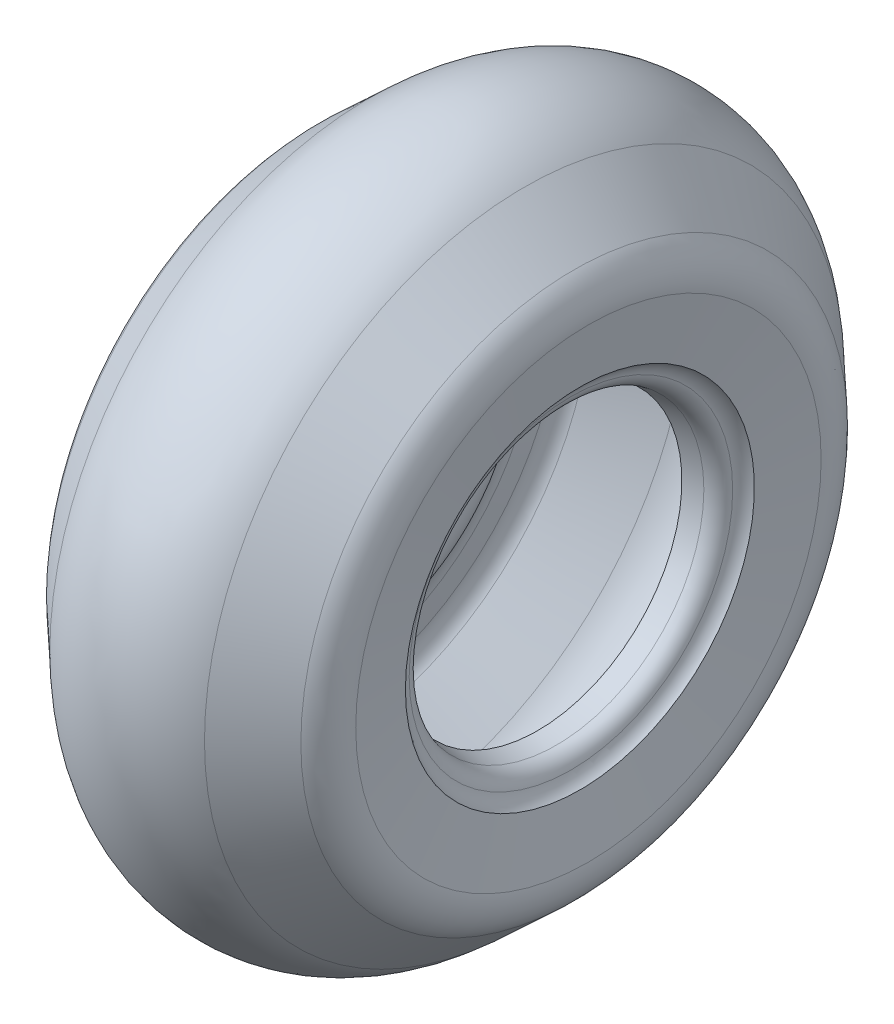
ISO-10303-21;
HEADER;
FILE_DESCRIPTION(('STEP AP214'),'2;1');
FILE_NAME('part.step','',(''),(''),'','','');
FILE_SCHEMA(('AUTOMOTIVE_DESIGN { 1 0 10303 214 1 1 1 1 }'));
ENDSEC;
DATA;
#1=APPLICATION_CONTEXT('core data for automotive mechanical design processes');
#2=APPLICATION_PROTOCOL_DEFINITION('international standard','automotive_design',2000,#1);
#3=PRODUCT_CONTEXT('',#1,'mechanical');
#4=PRODUCT('Part','Part','',(#3));
#5=PRODUCT_RELATED_PRODUCT_CATEGORY('part','',(#4));
#6=PRODUCT_DEFINITION_FORMATION('','',#4);
#7=PRODUCT_DEFINITION_CONTEXT('part definition',#1,'design');
#8=PRODUCT_DEFINITION('design','',#6,#7);
#9=PRODUCT_DEFINITION_SHAPE('','',#8);
#10=(LENGTH_UNIT() NAMED_UNIT(*) SI_UNIT(.MILLI.,.METRE.));
#11=(NAMED_UNIT(*) PLANE_ANGLE_UNIT() SI_UNIT($,.RADIAN.));
#12=(NAMED_UNIT(*) SI_UNIT($,.STERADIAN.) SOLID_ANGLE_UNIT());
#13=UNCERTAINTY_MEASURE_WITH_UNIT(LENGTH_MEASURE(1.E-05),#10,'distance_accuracy_value','');
#14=(GEOMETRIC_REPRESENTATION_CONTEXT(3) GLOBAL_UNCERTAINTY_ASSIGNED_CONTEXT((#13)) GLOBAL_UNIT_ASSIGNED_CONTEXT((#10,
#11,#12)) REPRESENTATION_CONTEXT('',''));
#15=CARTESIAN_POINT('',(0.,0.,0.));
#16=DIRECTION('',(0.,0.,1.));
#17=DIRECTION('',(1.,0.,0.));
#18=AXIS2_PLACEMENT_3D('',#15,#16,#17);
#19=CARTESIAN_POINT('',(0.,0.,0.));
#20=DIRECTION('',(-1.,0.,0.));
#21=DIRECTION('',(0.,0.,1.));
#22=AXIS2_PLACEMENT_3D('',#19,#20,#21);
#23=TOROIDAL_SURFACE('',#22,197.225,94.3690016030858);
#24=CARTESIAN_POINT('',(64.3595043340397,0.,0.));
#25=DIRECTION('',(-1.,0.,0.));
#26=DIRECTION('',(0.,0.,1.));
#27=AXIS2_PLACEMENT_3D('',#24,#25,#26);
#28=CIRCLE('',#27,266.242118640522);
#29=CARTESIAN_POINT('',(64.3595043340397,0.,266.242118640522));
#30=VERTEX_POINT('',#29);
#31=EDGE_CURVE('E10',#30,#30,#28,.T.);
#32=ORIENTED_EDGE('',*,*,#31,.T.);
#33=EDGE_LOOP('',(#32));
#34=FACE_BOUND('',#33,.T.);
#35=CARTESIAN_POINT('',(-64.3595043340397,0.,0.));
#36=DIRECTION('',(-1.,0.,0.));
#37=DIRECTION('',(0.,0.,1.));
#38=AXIS2_PLACEMENT_3D('',#35,#36,#37);
#39=CIRCLE('',#38,266.242118640522);
#40=CARTESIAN_POINT('',(-64.3595043340397,0.,266.242118640522));
#41=VERTEX_POINT('',#40);
#42=EDGE_CURVE('E140',#41,#41,#39,.T.);
#43=ORIENTED_EDGE('',*,*,#42,.F.);
#44=EDGE_LOOP('',(#43));
#45=FACE_BOUND('',#44,.T.);
#46=ADVANCED_FACE('F39',(#34,#45),#23,.T.);
#47=CARTESIAN_POINT('',(64.3595043340397,0.,0.));
#48=DIRECTION('',(-1.,0.,0.));
#49=DIRECTION('',(0.,0.,1.));
#50=AXIS2_PLACEMENT_3D('',#47,#48,#49);
#51=CONICAL_SURFACE('',#50,266.242118640522,0.750491578357559);
#52=CARTESIAN_POINT('',(105.87360829989,0.,0.));
#53=DIRECTION('',(-1.,0.,0.));
#54=DIRECTION('',(0.,0.,1.));
#55=AXIS2_PLACEMENT_3D('',#52,#53,#54);
#56=CIRCLE('',#55,227.52959040488);
#57=CARTESIAN_POINT('',(105.87360829989,0.,227.52959040488));
#58=VERTEX_POINT('',#57);
#59=EDGE_CURVE('E46',#58,#58,#56,.T.);
#60=ORIENTED_EDGE('',*,*,#59,.T.);
#61=EDGE_LOOP('',(#60));
#62=FACE_BOUND('',#61,.T.);
#63=ORIENTED_EDGE('',*,*,#31,.F.);
#64=EDGE_LOOP('',(#63));
#65=FACE_BOUND('',#64,.T.);
#66=ADVANCED_FACE('F150',(#62,#65),#51,.T.);
#67=CARTESIAN_POINT('',(79.5569965809781,0.,0.));
#68=DIRECTION('',(-1.,0.,0.));
#69=DIRECTION('',(0.,0.,1.));
#70=AXIS2_PLACEMENT_3D('',#67,#68,#69);
#71=TOROIDAL_SURFACE('',#70,199.30847944365,38.5875);
#72=CARTESIAN_POINT('',(117.73475,0.,0.));
#73=DIRECTION('',(-1.,0.,0.));
#74=DIRECTION('',(0.,0.,1.));
#75=AXIS2_PLACEMENT_3D('',#72,#73,#74);
#76=CIRCLE('',#75,193.700066109528);
#77=CARTESIAN_POINT('',(117.73475,0.,193.700066109528));
#78=VERTEX_POINT('',#77);
#79=EDGE_CURVE('E52',#78,#78,#76,.T.);
#80=ORIENTED_EDGE('',*,*,#79,.T.);
#81=EDGE_LOOP('',(#80));
#82=FACE_BOUND('',#81,.T.);
#83=ORIENTED_EDGE('',*,*,#59,.F.);
#84=EDGE_LOOP('',(#83));
#85=FACE_BOUND('',#84,.T.);
#86=ADVANCED_FACE('F154',(#82,#85),#71,.T.);
#87=CARTESIAN_POINT('',(117.73475,0.,0.));
#88=DIRECTION('',(1.,0.,0.));
#89=DIRECTION('',(0.,0.,-1.));
#90=AXIS2_PLACEMENT_3D('',#87,#88,#89);
#91=CONICAL_SURFACE('',#90,193.700066109528,1.42493693532447);
#92=CARTESIAN_POINT('',(110.6175,0.,0.));
#93=DIRECTION('',(-1.,0.,0.));
#94=DIRECTION('',(0.,0.,1.));
#95=AXIS2_PLACEMENT_3D('',#92,#93,#94);
#96=CIRCLE('',#95,145.251316109528);
#97=CARTESIAN_POINT('',(110.6175,0.,145.251316109528));
#98=VERTEX_POINT('',#97);
#99=EDGE_CURVE('E58',#98,#98,#96,.T.);
#100=ORIENTED_EDGE('',*,*,#99,.T.);
#101=EDGE_LOOP('',(#100));
#102=FACE_BOUND('',#101,.T.);
#103=ORIENTED_EDGE('',*,*,#79,.F.);
#104=EDGE_LOOP('',(#103));
#105=FACE_BOUND('',#104,.T.);
#106=ADVANCED_FACE('F158',(#102,#105),#91,.F.);
#107=CARTESIAN_POINT('',(119.869637613001,0.,0.));
#108=DIRECTION('',(-1.,0.,0.));
#109=DIRECTION('',(0.,0.,1.));
#110=AXIS2_PLACEMENT_3D('',#107,#108,#109);
#111=TOROIDAL_SURFACE('',#110,130.811078937304,17.15);
#112=CARTESIAN_POINT('',(103.154901682086,0.,0.));
#113=DIRECTION('',(-1.,0.,0.));
#114=DIRECTION('',(0.,0.,1.));
#115=AXIS2_PLACEMENT_3D('',#112,#113,#114);
#116=CIRCLE('',#115,134.650363084092);
#117=CARTESIAN_POINT('',(103.154901682086,0.,134.650363084092));
#118=VERTEX_POINT('',#117);
#119=EDGE_CURVE('E64',#118,#118,#116,.T.);
#120=ORIENTED_EDGE('',*,*,#119,.T.);
#121=EDGE_LOOP('',(#120));
#122=FACE_BOUND('',#121,.T.);
#123=ORIENTED_EDGE('',*,*,#99,.F.);
#124=EDGE_LOOP('',(#123));
#125=FACE_BOUND('',#124,.T.);
#126=ADVANCED_FACE('F165',(#122,#125),#111,.F.);
#127=CARTESIAN_POINT('',(88.1116393442622,0.,0.));
#128=DIRECTION('',(-1.,0.,0.));
#129=DIRECTION('',(0.,0.,1.));
#130=AXIS2_PLACEMENT_3D('',#127,#128,#129);
#131=TOROIDAL_SURFACE('',#130,138.105718816201,15.435);
#132=CARTESIAN_POINT('',(90.895,0.,0.));
#133=DIRECTION('',(-1.,0.,0.));
#134=DIRECTION('',(0.,0.,1.));
#135=AXIS2_PLACEMENT_3D('',#132,#133,#134);
#136=CIRCLE('',#135,122.923751603086);
#137=CARTESIAN_POINT('',(90.895,0.,122.923751603086));
#138=VERTEX_POINT('',#137);
#139=EDGE_CURVE('E68',#138,#138,#136,.T.);
#140=ORIENTED_EDGE('',*,*,#139,.T.);
#141=EDGE_LOOP('',(#140));
#142=FACE_BOUND('',#141,.T.);
#143=ORIENTED_EDGE('',*,*,#119,.F.);
#144=EDGE_LOOP('',(#143));
#145=FACE_BOUND('',#144,.T.);
#146=ADVANCED_FACE('F169',(#142,#145),#131,.T.);
#147=CARTESIAN_POINT('',(90.895,0.,0.));
#148=DIRECTION('',(1.,0.,0.));
#149=DIRECTION('',(0.,0.,-1.));
#150=AXIS2_PLACEMENT_3D('',#147,#148,#149);
#151=CONICAL_SURFACE('',#150,122.923751603086,0.181319774401494);
#152=CARTESIAN_POINT('',(75.46,0.,0.));
#153=DIRECTION('',(-1.,0.,0.));
#154=DIRECTION('',(0.,0.,1.));
#155=AXIS2_PLACEMENT_3D('',#152,#153,#154);
#156=CIRCLE('',#155,120.094001603086);
#157=CARTESIAN_POINT('',(75.46,0.,120.094001603086));
#158=VERTEX_POINT('',#157);
#159=EDGE_CURVE('E72',#158,#158,#156,.T.);
#160=ORIENTED_EDGE('',*,*,#159,.T.);
#161=EDGE_LOOP('',(#160));
#162=FACE_BOUND('',#161,.T.);
#163=ORIENTED_EDGE('',*,*,#139,.F.);
#164=EDGE_LOOP('',(#163));
#165=FACE_BOUND('',#164,.T.);
#166=ADVANCED_FACE('F173',(#162,#165),#151,.F.);
#167=CARTESIAN_POINT('',(123.352659152275,0.,0.));
#168=DIRECTION('',(-1.,0.,0.));
#169=DIRECTION('',(0.,0.,1.));
#170=AXIS2_PLACEMENT_3D('',#167,#168,#169);
#171=TOROIDAL_SURFACE('',#170,116.599205568409,48.02);
#172=CARTESIAN_POINT('',(87.8423,0.,0.));
#173=DIRECTION('',(-1.,0.,0.));
#174=DIRECTION('',(0.,0.,1.));
#175=AXIS2_PLACEMENT_3D('',#172,#173,#174);
#176=CIRCLE('',#175,148.924656731176);
#177=CARTESIAN_POINT('',(87.8423,0.,148.924656731176));
#178=VERTEX_POINT('',#177);
#179=EDGE_CURVE('E76',#178,#178,#176,.T.);
#180=ORIENTED_EDGE('',*,*,#179,.T.);
#181=EDGE_LOOP('',(#180));
#182=FACE_BOUND('',#181,.T.);
#183=ORIENTED_EDGE('',*,*,#159,.F.);
#184=EDGE_LOOP('',(#183));
#185=FACE_BOUND('',#184,.T.);
#186=ADVANCED_FACE('F177',(#182,#185),#171,.T.);
#187=CARTESIAN_POINT('',(43.4543510596561,0.,0.));
#188=DIRECTION('',(-1.,0.,0.));
#189=DIRECTION('',(0.,0.,1.));
#190=AXIS2_PLACEMENT_3D('',#187,#188,#189);
#191=TOROIDAL_SURFACE('',#190,189.331470684634,60.025);
#192=CARTESIAN_POINT('',(102.521721627711,0.,0.));
#193=DIRECTION('',(-1.,0.,0.));
#194=DIRECTION('',(0.,0.,1.));
#195=AXIS2_PLACEMENT_3D('',#192,#193,#194);
#196=CIRCLE('',#195,178.652221685942);
#197=CARTESIAN_POINT('',(102.521721627711,0.,178.652221685942));
#198=VERTEX_POINT('',#197);
#199=EDGE_CURVE('E80',#198,#198,#196,.T.);
#200=ORIENTED_EDGE('',*,*,#199,.T.);
#201=EDGE_LOOP('',(#200));
#202=FACE_BOUND('',#201,.T.);
#203=ORIENTED_EDGE('',*,*,#179,.F.);
#204=EDGE_LOOP('',(#203));
#205=FACE_BOUND('',#204,.T.);
#206=ADVANCED_FACE('F181',(#202,#205),#191,.F.);
#207=CARTESIAN_POINT('',(102.521721627711,0.,0.));
#208=DIRECTION('',(1.,0.,0.));
#209=DIRECTION('',(0.,0.,-1.));
#210=AXIS2_PLACEMENT_3D('',#207,#208,#209);
#211=CONICAL_SURFACE('',#210,178.652221685942,1.39193076077594);
#212=CARTESIAN_POINT('',(106.630125,0.,0.));
#213=DIRECTION('',(-1.,0.,0.));
#214=DIRECTION('',(0.,0.,1.));
#215=AXIS2_PLACEMENT_3D('',#212,#213,#214);
#216=CIRCLE('',#215,201.375971685942);
#217=CARTESIAN_POINT('',(106.630125,0.,201.375971685942));
#218=VERTEX_POINT('',#217);
#219=EDGE_CURVE('E84',#218,#218,#216,.T.);
#220=ORIENTED_EDGE('',*,*,#219,.T.);
#221=EDGE_LOOP('',(#220));
#222=FACE_BOUND('',#221,.T.);
#223=ORIENTED_EDGE('',*,*,#199,.F.);
#224=EDGE_LOOP('',(#223));
#225=FACE_BOUND('',#224,.T.);
#226=ADVANCED_FACE('F185',(#222,#225),#211,.T.);
#227=CARTESIAN_POINT('',(85.1127257216372,0.,0.));
#228=DIRECTION('',(-1.,0.,0.));
#229=DIRECTION('',(0.,0.,1.));
#230=AXIS2_PLACEMENT_3D('',#227,#228,#229);
#231=TOROIDAL_SURFACE('',#230,205.266269535465,21.86625);
#232=CARTESIAN_POINT('',(100.025472362354,0.,0.));
#233=DIRECTION('',(-1.,0.,0.));
#234=DIRECTION('',(0.,0.,1.));
#235=AXIS2_PLACEMENT_3D('',#232,#233,#234);
#236=CIRCLE('',#235,221.258232413496);
#237=CARTESIAN_POINT('',(100.025472362354,0.,221.258232413496));
#238=VERTEX_POINT('',#237);
#239=EDGE_CURVE('E88',#238,#238,#236,.T.);
#240=ORIENTED_EDGE('',*,*,#239,.T.);
#241=EDGE_LOOP('',(#240));
#242=FACE_BOUND('',#241,.T.);
#243=ORIENTED_EDGE('',*,*,#219,.F.);
#244=EDGE_LOOP('',(#243));
#245=FACE_BOUND('',#244,.T.);
#246=ADVANCED_FACE('F189',(#242,#245),#231,.F.);
#247=CARTESIAN_POINT('',(100.025472362354,0.,0.));
#248=DIRECTION('',(-1.,0.,0.));
#249=DIRECTION('',(0.,0.,1.));
#250=AXIS2_PLACEMENT_3D('',#247,#248,#249);
#251=CONICAL_SURFACE('',#250,221.258232413496,0.75049157835756);
#252=CARTESIAN_POINT('',(58.5113683965037,0.,0.));
#253=DIRECTION('',(-1.,0.,0.));
#254=DIRECTION('',(0.,0.,1.));
#255=AXIS2_PLACEMENT_3D('',#252,#253,#254);
#256=CIRCLE('',#255,259.970760649138);
#257=CARTESIAN_POINT('',(58.5113683965037,0.,259.970760649138));
#258=VERTEX_POINT('',#257);
#259=EDGE_CURVE('E92',#258,#258,#256,.T.);
#260=ORIENTED_EDGE('',*,*,#259,.T.);
#261=EDGE_LOOP('',(#260));
#262=FACE_BOUND('',#261,.T.);
#263=ORIENTED_EDGE('',*,*,#239,.F.);
#264=EDGE_LOOP('',(#263));
#265=FACE_BOUND('',#264,.T.);
#266=ADVANCED_FACE('F193',(#262,#265),#251,.F.);
#267=CARTESIAN_POINT('',(0.,0.,0.));
#268=DIRECTION('',(-1.,0.,0.));
#269=DIRECTION('',(0.,0.,1.));
#270=AXIS2_PLACEMENT_3D('',#267,#268,#269);
#271=TOROIDAL_SURFACE('',#270,197.225,85.7940016030858);
#272=CARTESIAN_POINT('',(-58.5113683965038,0.,0.));
#273=DIRECTION('',(-1.,0.,0.));
#274=DIRECTION('',(0.,0.,1.));
#275=AXIS2_PLACEMENT_3D('',#272,#273,#274);
#276=CIRCLE('',#275,259.970760649138);
#277=CARTESIAN_POINT('',(-58.5113683965038,0.,259.970760649138));
#278=VERTEX_POINT('',#277);
#279=EDGE_CURVE('E96',#278,#278,#276,.T.);
#280=ORIENTED_EDGE('',*,*,#279,.T.);
#281=EDGE_LOOP('',(#280));
#282=FACE_BOUND('',#281,.T.);
#283=ORIENTED_EDGE('',*,*,#259,.F.);
#284=EDGE_LOOP('',(#283));
#285=FACE_BOUND('',#284,.T.);
#286=ADVANCED_FACE('F197',(#282,#285),#271,.F.);
#287=CARTESIAN_POINT('',(-58.5113683965038,0.,0.));
#288=DIRECTION('',(1.,0.,0.));
#289=DIRECTION('',(0.,0.,-1.));
#290=AXIS2_PLACEMENT_3D('',#287,#288,#289);
#291=CONICAL_SURFACE('',#290,259.970760649138,0.75049157835756);
#292=CARTESIAN_POINT('',(-100.025472362354,0.,0.));
#293=DIRECTION('',(-1.,0.,0.));
#294=DIRECTION('',(0.,0.,1.));
#295=AXIS2_PLACEMENT_3D('',#292,#293,#294);
#296=CIRCLE('',#295,221.258232413496);
#297=CARTESIAN_POINT('',(-100.025472362354,0.,221.258232413496));
#298=VERTEX_POINT('',#297);
#299=EDGE_CURVE('E100',#298,#298,#296,.T.);
#300=ORIENTED_EDGE('',*,*,#299,.T.);
#301=EDGE_LOOP('',(#300));
#302=FACE_BOUND('',#301,.T.);
#303=ORIENTED_EDGE('',*,*,#279,.F.);
#304=EDGE_LOOP('',(#303));
#305=FACE_BOUND('',#304,.T.);
#306=ADVANCED_FACE('F201',(#302,#305),#291,.F.);
#307=CARTESIAN_POINT('',(-85.1127257216371,0.,0.));
#308=DIRECTION('',(-1.,0.,0.));
#309=DIRECTION('',(0.,0.,1.));
#310=AXIS2_PLACEMENT_3D('',#307,#308,#309);
#311=TOROIDAL_SURFACE('',#310,205.266269535465,21.86625);
#312=CARTESIAN_POINT('',(-106.630125,0.,0.));
#313=DIRECTION('',(-1.,0.,0.));
#314=DIRECTION('',(0.,0.,1.));
#315=AXIS2_PLACEMENT_3D('',#312,#313,#314);
#316=CIRCLE('',#315,201.375971685942);
#317=CARTESIAN_POINT('',(-106.630125,0.,201.375971685942));
#318=VERTEX_POINT('',#317);
#319=EDGE_CURVE('E104',#318,#318,#316,.T.);
#320=ORIENTED_EDGE('',*,*,#319,.T.);
#321=EDGE_LOOP('',(#320));
#322=FACE_BOUND('',#321,.T.);
#323=ORIENTED_EDGE('',*,*,#299,.F.);
#324=EDGE_LOOP('',(#323));
#325=FACE_BOUND('',#324,.T.);
#326=ADVANCED_FACE('F205',(#322,#325),#311,.F.);
#327=CARTESIAN_POINT('',(-106.630125,0.,0.));
#328=DIRECTION('',(-1.,0.,0.));
#329=DIRECTION('',(0.,0.,1.));
#330=AXIS2_PLACEMENT_3D('',#327,#328,#329);
#331=CONICAL_SURFACE('',#330,201.375971685942,1.39193076077594);
#332=CARTESIAN_POINT('',(-102.521721627711,0.,0.));
#333=DIRECTION('',(-1.,0.,0.));
#334=DIRECTION('',(0.,0.,1.));
#335=AXIS2_PLACEMENT_3D('',#332,#333,#334);
#336=CIRCLE('',#335,178.652221685942);
#337=CARTESIAN_POINT('',(-102.521721627711,0.,178.652221685942));
#338=VERTEX_POINT('',#337);
#339=EDGE_CURVE('E108',#338,#338,#336,.T.);
#340=ORIENTED_EDGE('',*,*,#339,.T.);
#341=EDGE_LOOP('',(#340));
#342=FACE_BOUND('',#341,.T.);
#343=ORIENTED_EDGE('',*,*,#319,.F.);
#344=EDGE_LOOP('',(#343));
#345=FACE_BOUND('',#344,.T.);
#346=ADVANCED_FACE('F209',(#342,#345),#331,.T.);
#347=CARTESIAN_POINT('',(-43.4543510596561,0.,0.));
#348=DIRECTION('',(-1.,0.,0.));
#349=DIRECTION('',(0.,0.,1.));
#350=AXIS2_PLACEMENT_3D('',#347,#348,#349);
#351=TOROIDAL_SURFACE('',#350,189.331470684634,60.025);
#352=CARTESIAN_POINT('',(-87.8423,0.,0.));
#353=DIRECTION('',(-1.,0.,0.));
#354=DIRECTION('',(0.,0.,1.));
#355=AXIS2_PLACEMENT_3D('',#352,#353,#354);
#356=CIRCLE('',#355,148.924656731176);
#357=CARTESIAN_POINT('',(-87.8423,0.,148.924656731176));
#358=VERTEX_POINT('',#357);
#359=EDGE_CURVE('E112',#358,#358,#356,.T.);
#360=ORIENTED_EDGE('',*,*,#359,.T.);
#361=EDGE_LOOP('',(#360));
#362=FACE_BOUND('',#361,.T.);
#363=ORIENTED_EDGE('',*,*,#339,.F.);
#364=EDGE_LOOP('',(#363));
#365=FACE_BOUND('',#364,.T.);
#366=ADVANCED_FACE('F213',(#362,#365),#351,.F.);
#367=CARTESIAN_POINT('',(-123.352659152275,0.,0.));
#368=DIRECTION('',(-1.,0.,0.));
#369=DIRECTION('',(0.,0.,1.));
#370=AXIS2_PLACEMENT_3D('',#367,#368,#369);
#371=TOROIDAL_SURFACE('',#370,116.599205568409,48.02);
#372=CARTESIAN_POINT('',(-75.46,0.,0.));
#373=DIRECTION('',(-1.,0.,0.));
#374=DIRECTION('',(0.,0.,1.));
#375=AXIS2_PLACEMENT_3D('',#372,#373,#374);
#376=CIRCLE('',#375,120.094001603086);
#377=CARTESIAN_POINT('',(-75.46,0.,120.094001603086));
#378=VERTEX_POINT('',#377);
#379=EDGE_CURVE('E116',#378,#378,#376,.T.);
#380=ORIENTED_EDGE('',*,*,#379,.T.);
#381=EDGE_LOOP('',(#380));
#382=FACE_BOUND('',#381,.T.);
#383=ORIENTED_EDGE('',*,*,#359,.F.);
#384=EDGE_LOOP('',(#383));
#385=FACE_BOUND('',#384,.T.);
#386=ADVANCED_FACE('F217',(#382,#385),#371,.T.);
#387=CARTESIAN_POINT('',(-75.46,0.,0.));
#388=DIRECTION('',(-1.,0.,0.));
#389=DIRECTION('',(0.,0.,1.));
#390=AXIS2_PLACEMENT_3D('',#387,#388,#389);
#391=CONICAL_SURFACE('',#390,120.094001603086,0.181319774401496);
#392=CARTESIAN_POINT('',(-90.895,0.,0.));
#393=DIRECTION('',(-1.,0.,0.));
#394=DIRECTION('',(0.,0.,1.));
#395=AXIS2_PLACEMENT_3D('',#392,#393,#394);
#396=CIRCLE('',#395,122.923751603086);
#397=CARTESIAN_POINT('',(-90.895,0.,122.923751603086));
#398=VERTEX_POINT('',#397);
#399=EDGE_CURVE('E120',#398,#398,#396,.T.);
#400=ORIENTED_EDGE('',*,*,#399,.T.);
#401=EDGE_LOOP('',(#400));
#402=FACE_BOUND('',#401,.T.);
#403=ORIENTED_EDGE('',*,*,#379,.F.);
#404=EDGE_LOOP('',(#403));
#405=FACE_BOUND('',#404,.T.);
#406=ADVANCED_FACE('F221',(#402,#405),#391,.F.);
#407=CARTESIAN_POINT('',(-88.1116393442622,0.,0.));
#408=DIRECTION('',(-1.,0.,0.));
#409=DIRECTION('',(0.,0.,1.));
#410=AXIS2_PLACEMENT_3D('',#407,#408,#409);
#411=TOROIDAL_SURFACE('',#410,138.105718816201,15.435);
#412=CARTESIAN_POINT('',(-103.154901682086,0.,0.));
#413=DIRECTION('',(-1.,0.,0.));
#414=DIRECTION('',(0.,0.,1.));
#415=AXIS2_PLACEMENT_3D('',#412,#413,#414);
#416=CIRCLE('',#415,134.650363084092);
#417=CARTESIAN_POINT('',(-103.154901682086,0.,134.650363084092));
#418=VERTEX_POINT('',#417);
#419=EDGE_CURVE('E124',#418,#418,#416,.T.);
#420=ORIENTED_EDGE('',*,*,#419,.T.);
#421=EDGE_LOOP('',(#420));
#422=FACE_BOUND('',#421,.T.);
#423=ORIENTED_EDGE('',*,*,#399,.F.);
#424=EDGE_LOOP('',(#423));
#425=FACE_BOUND('',#424,.T.);
#426=ADVANCED_FACE('F225',(#422,#425),#411,.T.);
#427=CARTESIAN_POINT('',(-119.869637613001,0.,0.));
#428=DIRECTION('',(-1.,0.,0.));
#429=DIRECTION('',(0.,0.,1.));
#430=AXIS2_PLACEMENT_3D('',#427,#428,#429);
#431=TOROIDAL_SURFACE('',#430,130.811078937304,17.15);
#432=CARTESIAN_POINT('',(-110.6175,0.,0.));
#433=DIRECTION('',(-1.,0.,0.));
#434=DIRECTION('',(0.,0.,1.));
#435=AXIS2_PLACEMENT_3D('',#432,#433,#434);
#436=CIRCLE('',#435,145.251316109528);
#437=CARTESIAN_POINT('',(-110.6175,0.,145.251316109528));
#438=VERTEX_POINT('',#437);
#439=EDGE_CURVE('E128',#438,#438,#436,.T.);
#440=ORIENTED_EDGE('',*,*,#439,.T.);
#441=EDGE_LOOP('',(#440));
#442=FACE_BOUND('',#441,.T.);
#443=ORIENTED_EDGE('',*,*,#419,.F.);
#444=EDGE_LOOP('',(#443));
#445=FACE_BOUND('',#444,.T.);
#446=ADVANCED_FACE('F229',(#442,#445),#431,.F.);
#447=CARTESIAN_POINT('',(-110.6175,0.,0.));
#448=DIRECTION('',(-1.,0.,0.));
#449=DIRECTION('',(0.,0.,1.));
#450=AXIS2_PLACEMENT_3D('',#447,#448,#449);
#451=CONICAL_SURFACE('',#450,145.251316109528,1.42493693532447);
#452=CARTESIAN_POINT('',(-117.73475,0.,0.));
#453=DIRECTION('',(-1.,0.,0.));
#454=DIRECTION('',(0.,0.,1.));
#455=AXIS2_PLACEMENT_3D('',#452,#453,#454);
#456=CIRCLE('',#455,193.700066109529);
#457=CARTESIAN_POINT('',(-117.73475,0.,193.700066109529));
#458=VERTEX_POINT('',#457);
#459=EDGE_CURVE('E132',#458,#458,#456,.T.);
#460=ORIENTED_EDGE('',*,*,#459,.T.);
#461=EDGE_LOOP('',(#460));
#462=FACE_BOUND('',#461,.T.);
#463=ORIENTED_EDGE('',*,*,#439,.F.);
#464=EDGE_LOOP('',(#463));
#465=FACE_BOUND('',#464,.T.);
#466=ADVANCED_FACE('F233',(#462,#465),#451,.F.);
#467=CARTESIAN_POINT('',(-79.556996580978,0.,0.));
#468=DIRECTION('',(-1.,0.,0.));
#469=DIRECTION('',(0.,0.,1.));
#470=AXIS2_PLACEMENT_3D('',#467,#468,#469);
#471=TOROIDAL_SURFACE('',#470,199.30847944365,38.5875);
#472=CARTESIAN_POINT('',(-105.87360829989,0.,0.));
#473=DIRECTION('',(-1.,0.,0.));
#474=DIRECTION('',(0.,0.,1.));
#475=AXIS2_PLACEMENT_3D('',#472,#473,#474);
#476=CIRCLE('',#475,227.52959040488);
#477=CARTESIAN_POINT('',(-105.87360829989,0.,227.52959040488));
#478=VERTEX_POINT('',#477);
#479=EDGE_CURVE('E136',#478,#478,#476,.T.);
#480=ORIENTED_EDGE('',*,*,#479,.T.);
#481=EDGE_LOOP('',(#480));
#482=FACE_BOUND('',#481,.T.);
#483=ORIENTED_EDGE('',*,*,#459,.F.);
#484=EDGE_LOOP('',(#483));
#485=FACE_BOUND('',#484,.T.);
#486=ADVANCED_FACE('F237',(#482,#485),#471,.T.);
#487=CARTESIAN_POINT('',(-105.87360829989,0.,0.));
#488=DIRECTION('',(1.,0.,0.));
#489=DIRECTION('',(0.,0.,-1.));
#490=AXIS2_PLACEMENT_3D('',#487,#488,#489);
#491=CONICAL_SURFACE('',#490,227.52959040488,0.75049157835756);
#492=ORIENTED_EDGE('',*,*,#42,.T.);
#493=EDGE_LOOP('',(#492));
#494=FACE_BOUND('',#493,.T.);
#495=ORIENTED_EDGE('',*,*,#479,.F.);
#496=EDGE_LOOP('',(#495));
#497=FACE_BOUND('',#496,.T.);
#498=ADVANCED_FACE('F146',(#494,#497),#491,.T.);
#499=CLOSED_SHELL('',(#46,#66,#86,#106,#126,#146,#166,#186,#206,#226,#246,#266,#286,#306,#326,
#346,#366,#386,#406,#426,#446,#466,#486,#498));
#500=MANIFOLD_SOLID_BREP('B2',#499);
#501=ADVANCED_BREP_SHAPE_REPRESENTATION('',(#18,#500),#14);
#502=SHAPE_DEFINITION_REPRESENTATION(#9,#501);
ENDSEC;
END-ISO-10303-21;
